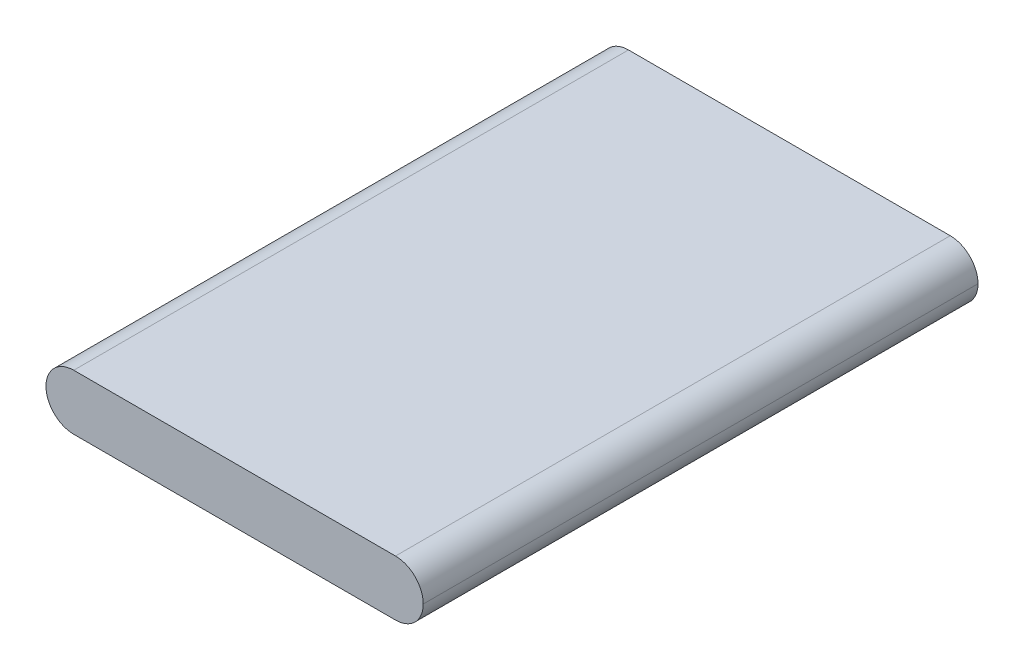
ISO-10303-21;
HEADER;
FILE_DESCRIPTION(('STEP AP214'),'2;1');
FILE_NAME('part.step','',(''),(''),'','','');
FILE_SCHEMA(('AUTOMOTIVE_DESIGN { 1 0 10303 214 1 1 1 1 }'));
ENDSEC;
DATA;
#1=APPLICATION_CONTEXT('core data for automotive mechanical design processes');
#2=APPLICATION_PROTOCOL_DEFINITION('international standard','automotive_design',2000,#1);
#3=PRODUCT_CONTEXT('',#1,'mechanical');
#4=PRODUCT('Part','Part','',(#3));
#5=PRODUCT_RELATED_PRODUCT_CATEGORY('part','',(#4));
#6=PRODUCT_DEFINITION_FORMATION('','',#4);
#7=PRODUCT_DEFINITION_CONTEXT('part definition',#1,'design');
#8=PRODUCT_DEFINITION('design','',#6,#7);
#9=PRODUCT_DEFINITION_SHAPE('','',#8);
#10=(LENGTH_UNIT() NAMED_UNIT(*) SI_UNIT(.MILLI.,.METRE.));
#11=(NAMED_UNIT(*) PLANE_ANGLE_UNIT() SI_UNIT($,.RADIAN.));
#12=(NAMED_UNIT(*) SI_UNIT($,.STERADIAN.) SOLID_ANGLE_UNIT());
#13=UNCERTAINTY_MEASURE_WITH_UNIT(LENGTH_MEASURE(1.E-05),#10,'distance_accuracy_value','');
#14=(GEOMETRIC_REPRESENTATION_CONTEXT(3) GLOBAL_UNCERTAINTY_ASSIGNED_CONTEXT((#13)) GLOBAL_UNIT_ASSIGNED_CONTEXT((#10,
#11,#12)) REPRESENTATION_CONTEXT('',''));
#15=CARTESIAN_POINT('',(0.,0.,0.));
#16=DIRECTION('',(0.,0.,1.));
#17=DIRECTION('',(1.,0.,0.));
#18=AXIS2_PLACEMENT_3D('',#15,#16,#17);
#19=CARTESIAN_POINT('',(-17.,5.,-25.));
#20=DIRECTION('',(0.,0.,1.));
#21=DIRECTION('',(1.,0.,0.));
#22=AXIS2_PLACEMENT_3D('',#19,#20,#21);
#23=PLANE('',#22);
#24=CARTESIAN_POINT('',(-14.5,2.5,-25.));
#25=DIRECTION('',(0.,0.,1.));
#26=DIRECTION('',(1.,0.,0.));
#27=AXIS2_PLACEMENT_3D('',#24,#25,#26);
#28=CIRCLE('',#27,2.5);
#29=CARTESIAN_POINT('',(-14.5,0.,-25.));
#30=VERTEX_POINT('',#29);
#31=CARTESIAN_POINT('',(-17.,2.5,-25.));
#32=VERTEX_POINT('',#31);
#33=EDGE_CURVE('E68',#30,#32,#28,.F.);
#34=ORIENTED_EDGE('',*,*,#33,.T.);
#35=CARTESIAN_POINT('',(-14.5,2.5,-25.));
#36=DIRECTION('',(0.,0.,1.));
#37=DIRECTION('',(1.,0.,0.));
#38=AXIS2_PLACEMENT_3D('',#35,#36,#37);
#39=CIRCLE('',#38,2.5);
#40=CARTESIAN_POINT('',(-14.5,5.,-25.));
#41=VERTEX_POINT('',#40);
#42=EDGE_CURVE('E113',#32,#41,#39,.F.);
#43=ORIENTED_EDGE('',*,*,#42,.T.);
#44=DIRECTION('',(-1.,0.,0.));
#45=VECTOR('',#44,1.);
#46=CARTESIAN_POINT('',(-17.,5.,-25.));
#47=LINE('',#46,#45);
#48=CARTESIAN_POINT('',(14.5,5.,-25.));
#49=VERTEX_POINT('',#48);
#50=EDGE_CURVE('E103',#49,#41,#47,.T.);
#51=ORIENTED_EDGE('',*,*,#50,.F.);
#52=CARTESIAN_POINT('',(14.5,2.5,-25.));
#53=DIRECTION('',(0.,0.,1.));
#54=DIRECTION('',(1.,0.,0.));
#55=AXIS2_PLACEMENT_3D('',#52,#53,#54);
#56=CIRCLE('',#55,2.5);
#57=CARTESIAN_POINT('',(17.,2.5,-25.));
#58=VERTEX_POINT('',#57);
#59=EDGE_CURVE('E61',#49,#58,#56,.F.);
#60=ORIENTED_EDGE('',*,*,#59,.T.);
#61=CARTESIAN_POINT('',(14.5,2.5,-25.));
#62=DIRECTION('',(0.,0.,1.));
#63=DIRECTION('',(1.,0.,0.));
#64=AXIS2_PLACEMENT_3D('',#61,#62,#63);
#65=CIRCLE('',#64,2.5);
#66=CARTESIAN_POINT('',(14.5,0.,-25.));
#67=VERTEX_POINT('',#66);
#68=EDGE_CURVE('E120',#58,#67,#65,.F.);
#69=ORIENTED_EDGE('',*,*,#68,.T.);
#70=DIRECTION('',(-1.,0.,0.));
#71=VECTOR('',#70,1.);
#72=CARTESIAN_POINT('',(-17.,0.,-25.));
#73=LINE('',#72,#71);
#74=EDGE_CURVE('E139',#67,#30,#73,.T.);
#75=ORIENTED_EDGE('',*,*,#74,.T.);
#76=EDGE_LOOP('',(#34,#43,#51,#60,#69,#75));
#77=FACE_BOUND('',#76,.T.);
#78=ADVANCED_FACE('F43',(#77),#23,.F.);
#79=CARTESIAN_POINT('',(-17.,5.,25.));
#80=DIRECTION('',(0.,0.,-1.));
#81=DIRECTION('',(-1.,0.,0.));
#82=AXIS2_PLACEMENT_3D('',#79,#80,#81);
#83=PLANE('',#82);
#84=DIRECTION('',(1.,0.,0.));
#85=VECTOR('',#84,1.);
#86=CARTESIAN_POINT('',(-17.,5.,25.));
#87=LINE('',#86,#85);
#88=CARTESIAN_POINT('',(-14.5,5.,25.));
#89=VERTEX_POINT('',#88);
#90=CARTESIAN_POINT('',(14.5,5.,25.));
#91=VERTEX_POINT('',#90);
#92=EDGE_CURVE('E106',#89,#91,#87,.T.);
#93=ORIENTED_EDGE('',*,*,#92,.F.);
#94=CARTESIAN_POINT('',(-14.5,2.5,25.));
#95=DIRECTION('',(0.,0.,-1.));
#96=DIRECTION('',(-1.,0.,0.));
#97=AXIS2_PLACEMENT_3D('',#94,#95,#96);
#98=CIRCLE('',#97,2.5);
#99=CARTESIAN_POINT('',(-17.,2.5,25.));
#100=VERTEX_POINT('',#99);
#101=EDGE_CURVE('E121',#89,#100,#98,.F.);
#102=ORIENTED_EDGE('',*,*,#101,.T.);
#103=CARTESIAN_POINT('',(-14.5,2.5,25.));
#104=DIRECTION('',(0.,0.,-1.));
#105=DIRECTION('',(-1.,0.,0.));
#106=AXIS2_PLACEMENT_3D('',#103,#104,#105);
#107=CIRCLE('',#106,2.5);
#108=CARTESIAN_POINT('',(-14.5,0.,25.));
#109=VERTEX_POINT('',#108);
#110=EDGE_CURVE('E126',#100,#109,#107,.F.);
#111=ORIENTED_EDGE('',*,*,#110,.T.);
#112=DIRECTION('',(1.,0.,0.));
#113=VECTOR('',#112,1.);
#114=CARTESIAN_POINT('',(-17.,0.,25.));
#115=LINE('',#114,#113);
#116=CARTESIAN_POINT('',(14.5,0.,25.));
#117=VERTEX_POINT('',#116);
#118=EDGE_CURVE('E115',#109,#117,#115,.T.);
#119=ORIENTED_EDGE('',*,*,#118,.T.);
#120=CARTESIAN_POINT('',(14.5,2.5,25.));
#121=DIRECTION('',(0.,0.,-1.));
#122=DIRECTION('',(-1.,0.,0.));
#123=AXIS2_PLACEMENT_3D('',#120,#121,#122);
#124=CIRCLE('',#123,2.5);
#125=CARTESIAN_POINT('',(17.,2.5,25.));
#126=VERTEX_POINT('',#125);
#127=EDGE_CURVE('E147',#117,#126,#124,.F.);
#128=ORIENTED_EDGE('',*,*,#127,.T.);
#129=CARTESIAN_POINT('',(14.5,2.5,25.));
#130=DIRECTION('',(0.,0.,-1.));
#131=DIRECTION('',(-1.,0.,0.));
#132=AXIS2_PLACEMENT_3D('',#129,#130,#131);
#133=CIRCLE('',#132,2.5);
#134=EDGE_CURVE('E159',#126,#91,#133,.F.);
#135=ORIENTED_EDGE('',*,*,#134,.T.);
#136=EDGE_LOOP('',(#93,#102,#111,#119,#128,#135));
#137=FACE_BOUND('',#136,.T.);
#138=ADVANCED_FACE('F168',(#137),#83,.F.);
#139=CARTESIAN_POINT('',(0.,5.,0.));
#140=DIRECTION('',(0.,-1.,0.));
#141=DIRECTION('',(0.,0.,-1.));
#142=AXIS2_PLACEMENT_3D('',#139,#140,#141);
#143=PLANE('',#142);
#144=ORIENTED_EDGE('',*,*,#50,.T.);
#145=DIRECTION('',(0.,0.,1.));
#146=VECTOR('',#145,1.);
#147=CARTESIAN_POINT('',(-14.5,5.,0.));
#148=LINE('',#147,#146);
#149=EDGE_CURVE('E110',#41,#89,#148,.T.);
#150=ORIENTED_EDGE('',*,*,#149,.T.);
#151=ORIENTED_EDGE('',*,*,#92,.T.);
#152=DIRECTION('',(0.,0.,-1.));
#153=VECTOR('',#152,1.);
#154=CARTESIAN_POINT('',(14.5,5.,0.));
#155=LINE('',#154,#153);
#156=EDGE_CURVE('E100',#91,#49,#155,.T.);
#157=ORIENTED_EDGE('',*,*,#156,.T.);
#158=EDGE_LOOP('',(#144,#150,#151,#157));
#159=FACE_BOUND('',#158,.T.);
#160=ADVANCED_FACE('F101',(#159),#143,.F.);
#161=CARTESIAN_POINT('',(0.,0.,0.));
#162=DIRECTION('',(0.,-1.,0.));
#163=DIRECTION('',(0.,0.,-1.));
#164=AXIS2_PLACEMENT_3D('',#161,#162,#163);
#165=PLANE('',#164);
#166=ORIENTED_EDGE('',*,*,#118,.F.);
#167=DIRECTION('',(0.,0.,1.));
#168=VECTOR('',#167,1.);
#169=CARTESIAN_POINT('',(-14.5,0.,-25.));
#170=LINE('',#169,#168);
#171=EDGE_CURVE('E11',#109,#30,#170,.F.);
#172=ORIENTED_EDGE('',*,*,#171,.T.);
#173=ORIENTED_EDGE('',*,*,#74,.F.);
#174=DIRECTION('',(0.,0.,-1.));
#175=VECTOR('',#174,1.);
#176=CARTESIAN_POINT('',(14.5,0.,25.));
#177=LINE('',#176,#175);
#178=EDGE_CURVE('E53',#67,#117,#177,.F.);
#179=ORIENTED_EDGE('',*,*,#178,.T.);
#180=EDGE_LOOP('',(#166,#172,#173,#179));
#181=FACE_BOUND('',#180,.T.);
#182=ADVANCED_FACE('F151',(#181),#165,.T.);
#183=CARTESIAN_POINT('',(-14.5,2.5,25.));
#184=DIRECTION('',(0.,0.,-1.));
#185=DIRECTION('',(-1.,0.,0.));
#186=AXIS2_PLACEMENT_3D('',#183,#184,#185);
#187=CYLINDRICAL_SURFACE('',#186,2.5);
#188=DIRECTION('',(0.,0.,1.));
#189=VECTOR('',#188,1.);
#190=CARTESIAN_POINT('',(-17.,2.5,25.));
#191=LINE('',#190,#189);
#192=EDGE_CURVE('E136',#32,#100,#191,.T.);
#193=ORIENTED_EDGE('',*,*,#192,.F.);
#194=ORIENTED_EDGE('',*,*,#33,.F.);
#195=ORIENTED_EDGE('',*,*,#171,.F.);
#196=ORIENTED_EDGE('',*,*,#110,.F.);
#197=EDGE_LOOP('',(#193,#194,#195,#196));
#198=FACE_BOUND('',#197,.T.);
#199=ADVANCED_FACE('F156',(#198),#187,.T.);
#200=CARTESIAN_POINT('',(-14.5,2.5,0.));
#201=DIRECTION('',(0.,0.,1.));
#202=DIRECTION('',(1.,0.,0.));
#203=AXIS2_PLACEMENT_3D('',#200,#201,#202);
#204=CYLINDRICAL_SURFACE('',#203,2.5);
#205=ORIENTED_EDGE('',*,*,#42,.F.);
#206=ORIENTED_EDGE('',*,*,#192,.T.);
#207=ORIENTED_EDGE('',*,*,#101,.F.);
#208=ORIENTED_EDGE('',*,*,#149,.F.);
#209=EDGE_LOOP('',(#205,#206,#207,#208));
#210=FACE_BOUND('',#209,.T.);
#211=ADVANCED_FACE('F157',(#210),#204,.T.);
#212=CARTESIAN_POINT('',(14.5,2.5,0.));
#213=DIRECTION('',(0.,0.,-1.));
#214=DIRECTION('',(-1.,0.,0.));
#215=AXIS2_PLACEMENT_3D('',#212,#213,#214);
#216=CYLINDRICAL_SURFACE('',#215,2.5);
#217=ORIENTED_EDGE('',*,*,#156,.F.);
#218=ORIENTED_EDGE('',*,*,#134,.F.);
#219=DIRECTION('',(0.,0.,-1.));
#220=VECTOR('',#219,1.);
#221=CARTESIAN_POINT('',(17.,2.5,25.));
#222=LINE('',#221,#220);
#223=EDGE_CURVE('E47',#58,#126,#222,.F.);
#224=ORIENTED_EDGE('',*,*,#223,.F.);
#225=ORIENTED_EDGE('',*,*,#59,.F.);
#226=EDGE_LOOP('',(#217,#218,#224,#225));
#227=FACE_BOUND('',#226,.T.);
#228=ADVANCED_FACE('F45',(#227),#216,.T.);
#229=CARTESIAN_POINT('',(14.5,2.5,25.));
#230=DIRECTION('',(0.,0.,1.));
#231=DIRECTION('',(1.,0.,0.));
#232=AXIS2_PLACEMENT_3D('',#229,#230,#231);
#233=CYLINDRICAL_SURFACE('',#232,2.5);
#234=ORIENTED_EDGE('',*,*,#127,.F.);
#235=ORIENTED_EDGE('',*,*,#178,.F.);
#236=ORIENTED_EDGE('',*,*,#68,.F.);
#237=ORIENTED_EDGE('',*,*,#223,.T.);
#238=EDGE_LOOP('',(#234,#235,#236,#237));
#239=FACE_BOUND('',#238,.T.);
#240=ADVANCED_FACE('F145',(#239),#233,.T.);
#241=CLOSED_SHELL('',(#78,#138,#160,#182,#199,#211,#228,#240));
#242=MANIFOLD_SOLID_BREP('B2',#241);
#243=ADVANCED_BREP_SHAPE_REPRESENTATION('',(#18,#242),#14);
#244=SHAPE_DEFINITION_REPRESENTATION(#9,#243);
ENDSEC;
END-ISO-10303-21;
